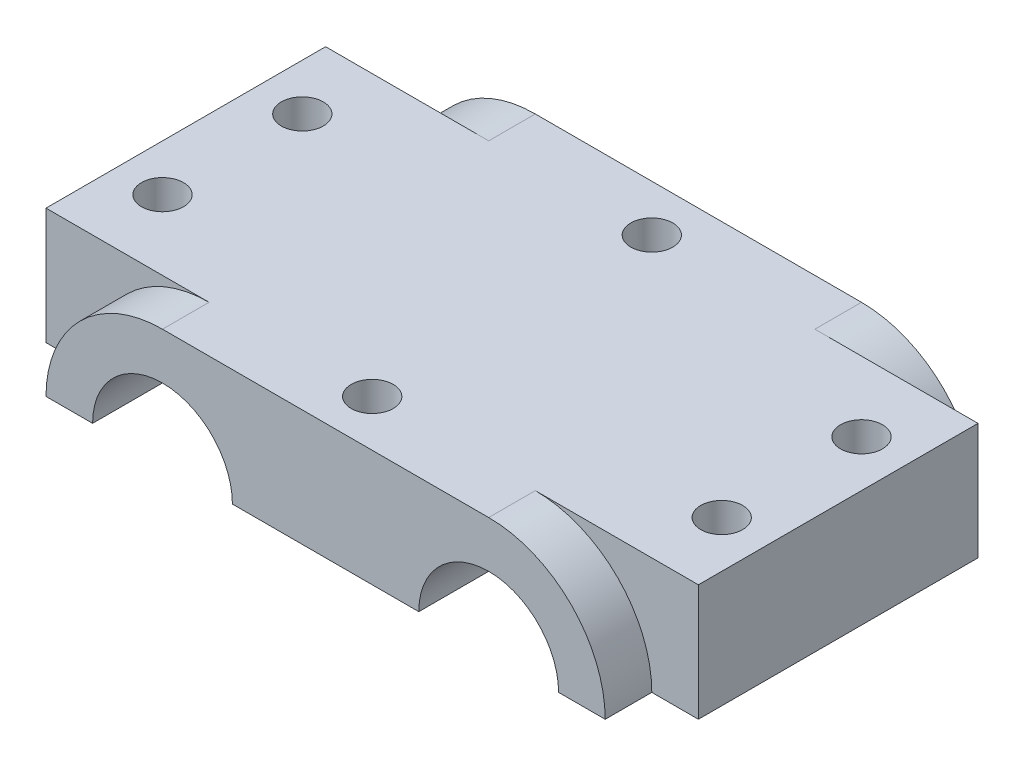
ISO-10303-21;
HEADER;
FILE_DESCRIPTION(('STEP AP214'),'2;1');
FILE_NAME('part.step','',(''),(''),'','','');
FILE_SCHEMA(('AUTOMOTIVE_DESIGN { 1 0 10303 214 1 1 1 1 }'));
ENDSEC;
DATA;
#1=APPLICATION_CONTEXT('core data for automotive mechanical design processes');
#2=APPLICATION_PROTOCOL_DEFINITION('international standard','automotive_design',2000,#1);
#3=PRODUCT_CONTEXT('',#1,'mechanical');
#4=PRODUCT('Part','Part','',(#3));
#5=PRODUCT_RELATED_PRODUCT_CATEGORY('part','',(#4));
#6=PRODUCT_DEFINITION_FORMATION('','',#4);
#7=PRODUCT_DEFINITION_CONTEXT('part definition',#1,'design');
#8=PRODUCT_DEFINITION('design','',#6,#7);
#9=PRODUCT_DEFINITION_SHAPE('','',#8);
#10=(LENGTH_UNIT() NAMED_UNIT(*) SI_UNIT(.MILLI.,.METRE.));
#11=(NAMED_UNIT(*) PLANE_ANGLE_UNIT() SI_UNIT($,.RADIAN.));
#12=(NAMED_UNIT(*) SI_UNIT($,.STERADIAN.) SOLID_ANGLE_UNIT());
#13=UNCERTAINTY_MEASURE_WITH_UNIT(LENGTH_MEASURE(1.E-05),#10,'distance_accuracy_value','');
#14=(GEOMETRIC_REPRESENTATION_CONTEXT(3) GLOBAL_UNCERTAINTY_ASSIGNED_CONTEXT((#13)) GLOBAL_UNIT_ASSIGNED_CONTEXT((#10,
#11,#12)) REPRESENTATION_CONTEXT('',''));
#15=CARTESIAN_POINT('',(0.,0.,0.));
#16=DIRECTION('',(0.,0.,1.));
#17=DIRECTION('',(1.,0.,0.));
#18=AXIS2_PLACEMENT_3D('',#15,#16,#17);
#19=CARTESIAN_POINT('',(0.,0.,30.));
#20=DIRECTION('',(0.,1.,0.));
#21=DIRECTION('',(0.,0.,1.));
#22=AXIS2_PLACEMENT_3D('',#19,#20,#21);
#23=PLANE('',#22);
#24=DIRECTION('',(1.,0.,0.));
#25=VECTOR('',#24,1.);
#26=CARTESIAN_POINT('',(0.,0.,0.));
#27=LINE('',#26,#25);
#28=CARTESIAN_POINT('',(0.,0.,0.));
#29=VERTEX_POINT('',#28);
#30=CARTESIAN_POINT('',(5.,0.,0.));
#31=VERTEX_POINT('',#30);
#32=EDGE_CURVE('E243',#29,#31,#27,.T.);
#33=ORIENTED_EDGE('',*,*,#32,.T.);
#34=DIRECTION('',(0.,0.,1.));
#35=VECTOR('',#34,1.);
#36=CARTESIAN_POINT('',(5.,0.,-5.));
#37=LINE('',#36,#35);
#38=CARTESIAN_POINT('',(5.,0.,-5.));
#39=VERTEX_POINT('',#38);
#40=EDGE_CURVE('E204',#39,#31,#37,.T.);
#41=ORIENTED_EDGE('',*,*,#40,.F.);
#42=DIRECTION('',(-1.,0.,0.));
#43=VECTOR('',#42,1.);
#44=CARTESIAN_POINT('',(5.,0.,-5.));
#45=LINE('',#44,#43);
#46=CARTESIAN_POINT('',(10.,0.,-5.));
#47=VERTEX_POINT('',#46);
#48=EDGE_CURVE('E183',#47,#39,#45,.T.);
#49=ORIENTED_EDGE('',*,*,#48,.F.);
#50=DIRECTION('',(0.,0.,-1.));
#51=VECTOR('',#50,1.);
#52=CARTESIAN_POINT('',(10.,0.,30.));
#53=LINE('',#52,#51);
#54=CARTESIAN_POINT('',(10.,0.,35.));
#55=VERTEX_POINT('',#54);
#56=EDGE_CURVE('E11',#55,#47,#53,.T.);
#57=ORIENTED_EDGE('',*,*,#56,.F.);
#58=DIRECTION('',(1.,0.,0.));
#59=VECTOR('',#58,1.);
#60=CARTESIAN_POINT('',(5.,0.,35.));
#61=LINE('',#60,#59);
#62=CARTESIAN_POINT('',(5.,0.,35.));
#63=VERTEX_POINT('',#62);
#64=EDGE_CURVE('E211',#63,#55,#61,.T.);
#65=ORIENTED_EDGE('',*,*,#64,.F.);
#66=DIRECTION('',(0.,0.,-1.));
#67=VECTOR('',#66,1.);
#68=CARTESIAN_POINT('',(5.,0.,35.));
#69=LINE('',#68,#67);
#70=CARTESIAN_POINT('',(5.,0.,30.));
#71=VERTEX_POINT('',#70);
#72=EDGE_CURVE('E240',#63,#71,#69,.T.);
#73=ORIENTED_EDGE('',*,*,#72,.T.);
#74=DIRECTION('',(1.,0.,0.));
#75=VECTOR('',#74,1.);
#76=CARTESIAN_POINT('',(0.,0.,30.));
#77=LINE('',#76,#75);
#78=CARTESIAN_POINT('',(0.,0.,30.));
#79=VERTEX_POINT('',#78);
#80=EDGE_CURVE('E244',#79,#71,#77,.T.);
#81=ORIENTED_EDGE('',*,*,#80,.F.);
#82=DIRECTION('',(0.,0.,-1.));
#83=VECTOR('',#82,1.);
#84=CARTESIAN_POINT('',(0.,0.,30.));
#85=LINE('',#84,#83);
#86=EDGE_CURVE('E256',#79,#29,#85,.T.);
#87=ORIENTED_EDGE('',*,*,#86,.T.);
#88=EDGE_LOOP('',(#33,#41,#49,#57,#65,#73,#81,#87));
#89=FACE_BOUND('',#88,.T.);
#90=CARTESIAN_POINT('',(5.,0.,7.5));
#91=DIRECTION('',(0.,-1.,0.));
#92=DIRECTION('',(0.,0.,-1.));
#93=AXIS2_PLACEMENT_3D('',#90,#91,#92);
#94=CIRCLE('',#93,2.25);
#95=CARTESIAN_POINT('',(5.,0.,5.25000000000001));
#96=VERTEX_POINT('',#95);
#97=EDGE_CURVE('E194',#96,#96,#94,.T.);
#98=ORIENTED_EDGE('',*,*,#97,.F.);
#99=EDGE_LOOP('',(#98));
#100=FACE_BOUND('',#99,.T.);
#101=CARTESIAN_POINT('',(5.,0.,22.5));
#102=DIRECTION('',(0.,1.,0.));
#103=DIRECTION('',(0.,0.,1.));
#104=AXIS2_PLACEMENT_3D('',#101,#102,#103);
#105=CIRCLE('',#104,2.25);
#106=CARTESIAN_POINT('',(5.,0.,24.75));
#107=VERTEX_POINT('',#106);
#108=EDGE_CURVE('E447',#107,#107,#105,.T.);
#109=ORIENTED_EDGE('',*,*,#108,.T.);
#110=EDGE_LOOP('',(#109));
#111=FACE_BOUND('',#110,.T.);
#112=ADVANCED_FACE('F40',(#89,#100,#111),#23,.F.);
#113=CARTESIAN_POINT('',(25.,0.,30.));
#114=DIRECTION('',(0.,1.,0.));
#115=DIRECTION('',(0.,0.,1.));
#116=AXIS2_PLACEMENT_3D('',#113,#114,#115);
#117=PLANE('',#116);
#118=CARTESIAN_POINT('',(35.,0.,0.));
#119=DIRECTION('',(0.,1.,0.));
#120=DIRECTION('',(0.,0.,1.));
#121=AXIS2_PLACEMENT_3D('',#118,#119,#120);
#122=CIRCLE('',#121,2.25);
#123=CARTESIAN_POINT('',(35.,0.,2.25));
#124=VERTEX_POINT('',#123);
#125=EDGE_CURVE('E417',#124,#124,#122,.T.);
#126=ORIENTED_EDGE('',*,*,#125,.T.);
#127=EDGE_LOOP('',(#126));
#128=FACE_BOUND('',#127,.T.);
#129=DIRECTION('',(0.,0.,-1.));
#130=VECTOR('',#129,1.);
#131=CARTESIAN_POINT('',(25.,0.,30.));
#132=LINE('',#131,#130);
#133=CARTESIAN_POINT('',(25.,0.,35.));
#134=VERTEX_POINT('',#133);
#135=CARTESIAN_POINT('',(25.,0.,-5.));
#136=VERTEX_POINT('',#135);
#137=EDGE_CURVE('E47',#134,#136,#132,.T.);
#138=ORIENTED_EDGE('',*,*,#137,.T.);
#139=DIRECTION('',(-1.,0.,0.));
#140=VECTOR('',#139,1.);
#141=CARTESIAN_POINT('',(45.,0.,-5.));
#142=LINE('',#141,#140);
#143=CARTESIAN_POINT('',(45.,0.,-5.));
#144=VERTEX_POINT('',#143);
#145=EDGE_CURVE('E163',#144,#136,#142,.T.);
#146=ORIENTED_EDGE('',*,*,#145,.F.);
#147=DIRECTION('',(0.,0.,-1.));
#148=VECTOR('',#147,1.);
#149=CARTESIAN_POINT('',(45.,0.,30.));
#150=LINE('',#149,#148);
#151=CARTESIAN_POINT('',(45.,0.,35.));
#152=VERTEX_POINT('',#151);
#153=EDGE_CURVE('E150',#152,#144,#150,.T.);
#154=ORIENTED_EDGE('',*,*,#153,.F.);
#155=DIRECTION('',(1.,0.,0.));
#156=VECTOR('',#155,1.);
#157=CARTESIAN_POINT('',(25.,0.,35.));
#158=LINE('',#157,#156);
#159=EDGE_CURVE('E218',#134,#152,#158,.T.);
#160=ORIENTED_EDGE('',*,*,#159,.F.);
#161=EDGE_LOOP('',(#138,#146,#154,#160));
#162=FACE_BOUND('',#161,.T.);
#163=CARTESIAN_POINT('',(35.,0.,30.));
#164=DIRECTION('',(0.,-1.,0.));
#165=DIRECTION('',(0.,0.,-1.));
#166=AXIS2_PLACEMENT_3D('',#163,#164,#165);
#167=CIRCLE('',#166,2.25);
#168=CARTESIAN_POINT('',(35.,0.,27.75));
#169=VERTEX_POINT('',#168);
#170=EDGE_CURVE('E441',#169,#169,#167,.T.);
#171=ORIENTED_EDGE('',*,*,#170,.F.);
#172=EDGE_LOOP('',(#171));
#173=FACE_BOUND('',#172,.T.);
#174=ADVANCED_FACE('F164',(#128,#162,#173),#117,.F.);
#175=CARTESIAN_POINT('',(70.,0.,30.));
#176=DIRECTION('',(0.,1.,0.));
#177=DIRECTION('',(0.,0.,1.));
#178=AXIS2_PLACEMENT_3D('',#175,#176,#177);
#179=PLANE('',#178);
#180=CARTESIAN_POINT('',(65.,0.,7.5));
#181=DIRECTION('',(0.,1.,0.));
#182=DIRECTION('',(0.,0.,1.));
#183=AXIS2_PLACEMENT_3D('',#180,#181,#182);
#184=CIRCLE('',#183,2.25);
#185=CARTESIAN_POINT('',(65.,0.,9.75));
#186=VERTEX_POINT('',#185);
#187=EDGE_CURVE('E429',#186,#186,#184,.T.);
#188=ORIENTED_EDGE('',*,*,#187,.T.);
#189=EDGE_LOOP('',(#188));
#190=FACE_BOUND('',#189,.T.);
#191=DIRECTION('',(0.,0.,-1.));
#192=VECTOR('',#191,1.);
#193=CARTESIAN_POINT('',(60.,0.,30.));
#194=LINE('',#193,#192);
#195=CARTESIAN_POINT('',(60.,0.,35.));
#196=VERTEX_POINT('',#195);
#197=CARTESIAN_POINT('',(60.,0.,-5.));
#198=VERTEX_POINT('',#197);
#199=EDGE_CURVE('E160',#196,#198,#194,.T.);
#200=ORIENTED_EDGE('',*,*,#199,.T.);
#201=DIRECTION('',(-1.,0.,0.));
#202=VECTOR('',#201,1.);
#203=CARTESIAN_POINT('',(65.,0.,-5.));
#204=LINE('',#203,#202);
#205=CARTESIAN_POINT('',(65.,0.,-5.));
#206=VERTEX_POINT('',#205);
#207=EDGE_CURVE('E174',#206,#198,#204,.T.);
#208=ORIENTED_EDGE('',*,*,#207,.F.);
#209=DIRECTION('',(0.,0.,1.));
#210=VECTOR('',#209,1.);
#211=CARTESIAN_POINT('',(65.,0.,-5.));
#212=LINE('',#211,#210);
#213=CARTESIAN_POINT('',(65.,0.,0.));
#214=VERTEX_POINT('',#213);
#215=EDGE_CURVE('E192',#206,#214,#212,.T.);
#216=ORIENTED_EDGE('',*,*,#215,.T.);
#217=DIRECTION('',(1.,0.,0.));
#218=VECTOR('',#217,1.);
#219=CARTESIAN_POINT('',(70.,0.,0.));
#220=LINE('',#219,#218);
#221=CARTESIAN_POINT('',(70.,0.,0.));
#222=VERTEX_POINT('',#221);
#223=EDGE_CURVE('E54',#214,#222,#220,.T.);
#224=ORIENTED_EDGE('',*,*,#223,.T.);
#225=DIRECTION('',(0.,0.,-1.));
#226=VECTOR('',#225,1.);
#227=CARTESIAN_POINT('',(70.,0.,30.));
#228=LINE('',#227,#226);
#229=CARTESIAN_POINT('',(70.,0.,30.));
#230=VERTEX_POINT('',#229);
#231=EDGE_CURVE('E274',#230,#222,#228,.T.);
#232=ORIENTED_EDGE('',*,*,#231,.F.);
#233=DIRECTION('',(1.,0.,0.));
#234=VECTOR('',#233,1.);
#235=CARTESIAN_POINT('',(70.,0.,30.));
#236=LINE('',#235,#234);
#237=CARTESIAN_POINT('',(65.,0.,30.));
#238=VERTEX_POINT('',#237);
#239=EDGE_CURVE('E246',#238,#230,#236,.T.);
#240=ORIENTED_EDGE('',*,*,#239,.F.);
#241=DIRECTION('',(0.,0.,-1.));
#242=VECTOR('',#241,1.);
#243=CARTESIAN_POINT('',(65.,0.,35.));
#244=LINE('',#243,#242);
#245=CARTESIAN_POINT('',(65.,0.,35.));
#246=VERTEX_POINT('',#245);
#247=EDGE_CURVE('E237',#246,#238,#244,.T.);
#248=ORIENTED_EDGE('',*,*,#247,.F.);
#249=DIRECTION('',(1.,0.,0.));
#250=VECTOR('',#249,1.);
#251=CARTESIAN_POINT('',(65.,0.,35.));
#252=LINE('',#251,#250);
#253=EDGE_CURVE('E221',#196,#246,#252,.T.);
#254=ORIENTED_EDGE('',*,*,#253,.F.);
#255=EDGE_LOOP('',(#200,#208,#216,#224,#232,#240,#248,#254));
#256=FACE_BOUND('',#255,.T.);
#257=CARTESIAN_POINT('',(65.,0.,22.5));
#258=DIRECTION('',(0.,-1.,0.));
#259=DIRECTION('',(0.,0.,-1.));
#260=AXIS2_PLACEMENT_3D('',#257,#258,#259);
#261=CIRCLE('',#260,2.25);
#262=CARTESIAN_POINT('',(65.,0.,20.25));
#263=VERTEX_POINT('',#262);
#264=EDGE_CURVE('E435',#263,#263,#261,.T.);
#265=ORIENTED_EDGE('',*,*,#264,.F.);
#266=EDGE_LOOP('',(#265));
#267=FACE_BOUND('',#266,.T.);
#268=ADVANCED_FACE('F279',(#190,#256,#267),#179,.F.);
#269=CARTESIAN_POINT('',(0.,12.5,30.));
#270=DIRECTION('',(0.,-1.,0.));
#271=DIRECTION('',(0.,0.,-1.));
#272=AXIS2_PLACEMENT_3D('',#269,#270,#271);
#273=PLANE('',#272);
#274=CARTESIAN_POINT('',(65.,12.5,7.5));
#275=DIRECTION('',(0.,1.,0.));
#276=DIRECTION('',(0.,0.,1.));
#277=AXIS2_PLACEMENT_3D('',#274,#275,#276);
#278=CIRCLE('',#277,2.25);
#279=CARTESIAN_POINT('',(65.,12.5,9.75));
#280=VERTEX_POINT('',#279);
#281=EDGE_CURVE('E424',#280,#280,#278,.T.);
#282=ORIENTED_EDGE('',*,*,#281,.F.);
#283=EDGE_LOOP('',(#282));
#284=FACE_BOUND('',#283,.T.);
#285=DIRECTION('',(-1.,0.,0.));
#286=VECTOR('',#285,1.);
#287=CARTESIAN_POINT('',(0.,12.5,0.));
#288=LINE('',#287,#286);
#289=CARTESIAN_POINT('',(70.,12.5,0.));
#290=VERTEX_POINT('',#289);
#291=CARTESIAN_POINT('',(52.5,12.5,0.));
#292=VERTEX_POINT('',#291);
#293=EDGE_CURVE('E263',#290,#292,#288,.T.);
#294=ORIENTED_EDGE('',*,*,#293,.T.);
#295=DIRECTION('',(0.,0.,1.));
#296=VECTOR('',#295,1.);
#297=CARTESIAN_POINT('',(52.5,12.5,-5.));
#298=LINE('',#297,#296);
#299=CARTESIAN_POINT('',(52.5,12.5,-5.));
#300=VERTEX_POINT('',#299);
#301=EDGE_CURVE('E198',#300,#292,#298,.T.);
#302=ORIENTED_EDGE('',*,*,#301,.F.);
#303=DIRECTION('',(1.,0.,0.));
#304=VECTOR('',#303,1.);
#305=CARTESIAN_POINT('',(52.5,12.5,-5.));
#306=LINE('',#305,#304);
#307=CARTESIAN_POINT('',(17.5,12.5,-5.));
#308=VERTEX_POINT('',#307);
#309=EDGE_CURVE('E187',#308,#300,#306,.T.);
#310=ORIENTED_EDGE('',*,*,#309,.F.);
#311=DIRECTION('',(0.,0.,1.));
#312=VECTOR('',#311,1.);
#313=CARTESIAN_POINT('',(17.5,12.5,-5.));
#314=LINE('',#313,#312);
#315=CARTESIAN_POINT('',(17.5,12.5,0.));
#316=VERTEX_POINT('',#315);
#317=EDGE_CURVE('E201',#308,#316,#314,.T.);
#318=ORIENTED_EDGE('',*,*,#317,.T.);
#319=CARTESIAN_POINT('',(0.,12.5,0.));
#320=VERTEX_POINT('',#319);
#321=EDGE_CURVE('E262',#316,#320,#288,.T.);
#322=ORIENTED_EDGE('',*,*,#321,.T.);
#323=DIRECTION('',(0.,0.,-1.));
#324=VECTOR('',#323,1.);
#325=CARTESIAN_POINT('',(0.,12.5,30.));
#326=LINE('',#325,#324);
#327=CARTESIAN_POINT('',(0.,12.5,30.));
#328=VERTEX_POINT('',#327);
#329=EDGE_CURVE('E268',#328,#320,#326,.T.);
#330=ORIENTED_EDGE('',*,*,#329,.F.);
#331=DIRECTION('',(-1.,0.,0.));
#332=VECTOR('',#331,1.);
#333=CARTESIAN_POINT('',(0.,12.5,30.));
#334=LINE('',#333,#332);
#335=CARTESIAN_POINT('',(17.5,12.5,30.));
#336=VERTEX_POINT('',#335);
#337=EDGE_CURVE('E251',#336,#328,#334,.T.);
#338=ORIENTED_EDGE('',*,*,#337,.F.);
#339=DIRECTION('',(0.,0.,-1.));
#340=VECTOR('',#339,1.);
#341=CARTESIAN_POINT('',(17.5,12.5,35.));
#342=LINE('',#341,#340);
#343=CARTESIAN_POINT('',(17.5,12.5,35.));
#344=VERTEX_POINT('',#343);
#345=EDGE_CURVE('E227',#344,#336,#342,.T.);
#346=ORIENTED_EDGE('',*,*,#345,.F.);
#347=DIRECTION('',(-1.,0.,0.));
#348=VECTOR('',#347,1.);
#349=CARTESIAN_POINT('',(17.5,12.5,35.));
#350=LINE('',#349,#348);
#351=CARTESIAN_POINT('',(52.5,12.5,35.));
#352=VERTEX_POINT('',#351);
#353=EDGE_CURVE('E225',#352,#344,#350,.T.);
#354=ORIENTED_EDGE('',*,*,#353,.F.);
#355=DIRECTION('',(0.,0.,-1.));
#356=VECTOR('',#355,1.);
#357=CARTESIAN_POINT('',(52.5,12.5,35.));
#358=LINE('',#357,#356);
#359=CARTESIAN_POINT('',(52.5,12.5,30.));
#360=VERTEX_POINT('',#359);
#361=EDGE_CURVE('E234',#352,#360,#358,.T.);
#362=ORIENTED_EDGE('',*,*,#361,.T.);
#363=CARTESIAN_POINT('',(70.,12.5,30.));
#364=VERTEX_POINT('',#363);
#365=EDGE_CURVE('E252',#364,#360,#334,.T.);
#366=ORIENTED_EDGE('',*,*,#365,.F.);
#367=DIRECTION('',(0.,0.,-1.));
#368=VECTOR('',#367,1.);
#369=CARTESIAN_POINT('',(70.,12.5,30.));
#370=LINE('',#369,#368);
#371=EDGE_CURVE('E271',#364,#290,#370,.T.);
#372=ORIENTED_EDGE('',*,*,#371,.T.);
#373=EDGE_LOOP('',(#294,#302,#310,#318,#322,#330,#338,#346,#354,#362,#366,#372));
#374=FACE_BOUND('',#373,.T.);
#375=CARTESIAN_POINT('',(5.,12.5,7.5));
#376=DIRECTION('',(0.,-1.,0.));
#377=DIRECTION('',(0.,0.,-1.));
#378=AXIS2_PLACEMENT_3D('',#375,#376,#377);
#379=CIRCLE('',#378,2.25);
#380=CARTESIAN_POINT('',(5.,12.5,5.25000000000001));
#381=VERTEX_POINT('',#380);
#382=EDGE_CURVE('E179',#381,#381,#379,.T.);
#383=ORIENTED_EDGE('',*,*,#382,.T.);
#384=EDGE_LOOP('',(#383));
#385=FACE_BOUND('',#384,.T.);
#386=CARTESIAN_POINT('',(35.,12.5,0.));
#387=DIRECTION('',(0.,1.,0.));
#388=DIRECTION('',(0.,0.,1.));
#389=AXIS2_PLACEMENT_3D('',#386,#387,#388);
#390=CIRCLE('',#389,2.25);
#391=CARTESIAN_POINT('',(35.,12.5,2.25));
#392=VERTEX_POINT('',#391);
#393=EDGE_CURVE('E420',#392,#392,#390,.T.);
#394=ORIENTED_EDGE('',*,*,#393,.F.);
#395=EDGE_LOOP('',(#394));
#396=FACE_BOUND('',#395,.T.);
#397=CARTESIAN_POINT('',(65.,12.5,22.5));
#398=DIRECTION('',(0.,-1.,0.));
#399=DIRECTION('',(0.,0.,-1.));
#400=AXIS2_PLACEMENT_3D('',#397,#398,#399);
#401=CIRCLE('',#400,2.25);
#402=CARTESIAN_POINT('',(65.,12.5,20.25));
#403=VERTEX_POINT('',#402);
#404=EDGE_CURVE('E432',#403,#403,#401,.T.);
#405=ORIENTED_EDGE('',*,*,#404,.T.);
#406=EDGE_LOOP('',(#405));
#407=FACE_BOUND('',#406,.T.);
#408=CARTESIAN_POINT('',(35.,12.5,30.));
#409=DIRECTION('',(0.,-1.,0.));
#410=DIRECTION('',(0.,0.,-1.));
#411=AXIS2_PLACEMENT_3D('',#408,#409,#410);
#412=CIRCLE('',#411,2.25);
#413=CARTESIAN_POINT('',(35.,12.5,27.75));
#414=VERTEX_POINT('',#413);
#415=EDGE_CURVE('E438',#414,#414,#412,.T.);
#416=ORIENTED_EDGE('',*,*,#415,.T.);
#417=EDGE_LOOP('',(#416));
#418=FACE_BOUND('',#417,.T.);
#419=CARTESIAN_POINT('',(5.,12.5,22.5));
#420=DIRECTION('',(0.,1.,0.));
#421=DIRECTION('',(0.,0.,1.));
#422=AXIS2_PLACEMENT_3D('',#419,#420,#421);
#423=CIRCLE('',#422,2.25);
#424=CARTESIAN_POINT('',(5.,12.5,24.75));
#425=VERTEX_POINT('',#424);
#426=EDGE_CURVE('E444',#425,#425,#423,.T.);
#427=ORIENTED_EDGE('',*,*,#426,.F.);
#428=EDGE_LOOP('',(#427));
#429=FACE_BOUND('',#428,.T.);
#430=ADVANCED_FACE('F301',(#284,#374,#385,#396,#407,#418,#429),#273,.F.);
#431=CARTESIAN_POINT('',(17.5,0.,0.));
#432=DIRECTION('',(0.,0.,-1.));
#433=DIRECTION('',(-1.,0.,0.));
#434=AXIS2_PLACEMENT_3D('',#431,#432,#433);
#435=PLANE('',#434);
#436=CARTESIAN_POINT('',(52.5,0.,0.));
#437=DIRECTION('',(0.,0.,-1.));
#438=DIRECTION('',(1.,0.,0.));
#439=AXIS2_PLACEMENT_3D('',#436,#437,#438);
#440=CIRCLE('',#439,12.5);
#441=EDGE_CURVE('E58',#292,#214,#440,.T.);
#442=ORIENTED_EDGE('',*,*,#441,.F.);
#443=ORIENTED_EDGE('',*,*,#293,.F.);
#444=DIRECTION('',(0.,1.,0.));
#445=VECTOR('',#444,1.);
#446=CARTESIAN_POINT('',(70.,0.,0.));
#447=LINE('',#446,#445);
#448=EDGE_CURVE('E260',#222,#290,#447,.T.);
#449=ORIENTED_EDGE('',*,*,#448,.F.);
#450=ORIENTED_EDGE('',*,*,#223,.F.);
#451=EDGE_LOOP('',(#442,#443,#449,#450));
#452=FACE_BOUND('',#451,.T.);
#453=ADVANCED_FACE('F311',(#452),#435,.T.);
#454=CARTESIAN_POINT('',(17.5,0.,30.));
#455=DIRECTION('',(0.,0.,-1.));
#456=DIRECTION('',(-1.,0.,0.));
#457=AXIS2_PLACEMENT_3D('',#454,#455,#456);
#458=PLANE('',#457);
#459=CARTESIAN_POINT('',(17.5,0.,30.));
#460=DIRECTION('',(0.,0.,1.));
#461=DIRECTION('',(-1.,0.,0.));
#462=AXIS2_PLACEMENT_3D('',#459,#460,#461);
#463=CIRCLE('',#462,12.5);
#464=EDGE_CURVE('E207',#336,#71,#463,.T.);
#465=ORIENTED_EDGE('',*,*,#464,.F.);
#466=ORIENTED_EDGE('',*,*,#337,.T.);
#467=DIRECTION('',(0.,-1.,0.));
#468=VECTOR('',#467,1.);
#469=CARTESIAN_POINT('',(0.,0.,30.));
#470=LINE('',#469,#468);
#471=EDGE_CURVE('E254',#328,#79,#470,.T.);
#472=ORIENTED_EDGE('',*,*,#471,.T.);
#473=ORIENTED_EDGE('',*,*,#80,.T.);
#474=EDGE_LOOP('',(#465,#466,#472,#473));
#475=FACE_BOUND('',#474,.T.);
#476=ADVANCED_FACE('F313',(#475),#458,.F.);
#477=CARTESIAN_POINT('',(17.5,0.,30.));
#478=DIRECTION('',(0.,0.,-1.));
#479=DIRECTION('',(-1.,0.,0.));
#480=AXIS2_PLACEMENT_3D('',#477,#478,#479);
#481=CYLINDRICAL_SURFACE('',#480,7.5);
#482=ORIENTED_EDGE('',*,*,#56,.T.);
#483=CARTESIAN_POINT('',(17.5,0.,-5.));
#484=DIRECTION('',(0.,0.,1.));
#485=DIRECTION('',(-1.,0.,0.));
#486=AXIS2_PLACEMENT_3D('',#483,#484,#485);
#487=CIRCLE('',#486,7.5);
#488=EDGE_CURVE('E169',#136,#47,#487,.T.);
#489=ORIENTED_EDGE('',*,*,#488,.F.);
#490=ORIENTED_EDGE('',*,*,#137,.F.);
#491=CARTESIAN_POINT('',(17.5,0.,35.));
#492=DIRECTION('',(0.,0.,-1.));
#493=DIRECTION('',(-1.,0.,0.));
#494=AXIS2_PLACEMENT_3D('',#491,#492,#493);
#495=CIRCLE('',#494,7.5);
#496=EDGE_CURVE('E215',#55,#134,#495,.T.);
#497=ORIENTED_EDGE('',*,*,#496,.F.);
#498=EDGE_LOOP('',(#482,#489,#490,#497));
#499=FACE_BOUND('',#498,.T.);
#500=ADVANCED_FACE('F286',(#499),#481,.F.);
#501=CARTESIAN_POINT('',(52.5,0.,30.));
#502=DIRECTION('',(0.,0.,-1.));
#503=DIRECTION('',(-1.,0.,0.));
#504=AXIS2_PLACEMENT_3D('',#501,#502,#503);
#505=CYLINDRICAL_SURFACE('',#504,7.5);
#506=ORIENTED_EDGE('',*,*,#153,.T.);
#507=CARTESIAN_POINT('',(52.5,0.,-5.));
#508=DIRECTION('',(0.,0.,1.));
#509=DIRECTION('',(1.,0.,0.));
#510=AXIS2_PLACEMENT_3D('',#507,#508,#509);
#511=CIRCLE('',#510,7.5);
#512=EDGE_CURVE('E154',#198,#144,#511,.T.);
#513=ORIENTED_EDGE('',*,*,#512,.F.);
#514=ORIENTED_EDGE('',*,*,#199,.F.);
#515=CARTESIAN_POINT('',(52.5,0.,35.));
#516=DIRECTION('',(0.,0.,-1.));
#517=DIRECTION('',(1.,0.,0.));
#518=AXIS2_PLACEMENT_3D('',#515,#516,#517);
#519=CIRCLE('',#518,7.5);
#520=EDGE_CURVE('E156',#152,#196,#519,.T.);
#521=ORIENTED_EDGE('',*,*,#520,.F.);
#522=EDGE_LOOP('',(#506,#513,#514,#521));
#523=FACE_BOUND('',#522,.T.);
#524=ADVANCED_FACE('F152',(#523),#505,.F.);
#525=CARTESIAN_POINT('',(70.,0.,30.));
#526=DIRECTION('',(-1.,0.,0.));
#527=DIRECTION('',(0.,0.,1.));
#528=AXIS2_PLACEMENT_3D('',#525,#526,#527);
#529=PLANE('',#528);
#530=ORIENTED_EDGE('',*,*,#448,.T.);
#531=ORIENTED_EDGE('',*,*,#371,.F.);
#532=DIRECTION('',(0.,1.,0.));
#533=VECTOR('',#532,1.);
#534=CARTESIAN_POINT('',(70.,0.,30.));
#535=LINE('',#534,#533);
#536=EDGE_CURVE('E249',#230,#364,#535,.T.);
#537=ORIENTED_EDGE('',*,*,#536,.F.);
#538=ORIENTED_EDGE('',*,*,#231,.T.);
#539=EDGE_LOOP('',(#530,#531,#537,#538));
#540=FACE_BOUND('',#539,.T.);
#541=ADVANCED_FACE('F309',(#540),#529,.F.);
#542=CARTESIAN_POINT('',(0.,0.,30.));
#543=DIRECTION('',(1.,0.,0.));
#544=DIRECTION('',(0.,0.,-1.));
#545=AXIS2_PLACEMENT_3D('',#542,#543,#544);
#546=PLANE('',#545);
#547=DIRECTION('',(0.,-1.,0.));
#548=VECTOR('',#547,1.);
#549=CARTESIAN_POINT('',(0.,0.,0.));
#550=LINE('',#549,#548);
#551=EDGE_CURVE('E247',#320,#29,#550,.T.);
#552=ORIENTED_EDGE('',*,*,#551,.T.);
#553=ORIENTED_EDGE('',*,*,#86,.F.);
#554=ORIENTED_EDGE('',*,*,#471,.F.);
#555=ORIENTED_EDGE('',*,*,#329,.T.);
#556=EDGE_LOOP('',(#552,#553,#554,#555));
#557=FACE_BOUND('',#556,.T.);
#558=ADVANCED_FACE('F349',(#557),#546,.F.);
#559=CARTESIAN_POINT('',(52.5,0.,30.));
#560=DIRECTION('',(0.,0.,1.));
#561=DIRECTION('',(1.,0.,0.));
#562=AXIS2_PLACEMENT_3D('',#559,#560,#561);
#563=CIRCLE('',#562,12.5);
#564=EDGE_CURVE('E212',#238,#360,#563,.T.);
#565=ORIENTED_EDGE('',*,*,#564,.F.);
#566=ORIENTED_EDGE('',*,*,#239,.T.);
#567=ORIENTED_EDGE('',*,*,#536,.T.);
#568=ORIENTED_EDGE('',*,*,#365,.T.);
#569=EDGE_LOOP('',(#565,#566,#567,#568));
#570=FACE_BOUND('',#569,.T.);
#571=ADVANCED_FACE('F322',(#570),#458,.F.);
#572=CARTESIAN_POINT('',(17.5,0.,0.));
#573=DIRECTION('',(0.,0.,-1.));
#574=DIRECTION('',(-1.,0.,0.));
#575=AXIS2_PLACEMENT_3D('',#572,#573,#574);
#576=CIRCLE('',#575,12.5);
#577=EDGE_CURVE('E176',#31,#316,#576,.T.);
#578=ORIENTED_EDGE('',*,*,#577,.F.);
#579=ORIENTED_EDGE('',*,*,#32,.F.);
#580=ORIENTED_EDGE('',*,*,#551,.F.);
#581=ORIENTED_EDGE('',*,*,#321,.F.);
#582=EDGE_LOOP('',(#578,#579,#580,#581));
#583=FACE_BOUND('',#582,.T.);
#584=ADVANCED_FACE('F315',(#583),#435,.T.);
#585=CARTESIAN_POINT('',(17.5,0.,35.));
#586=DIRECTION('',(0.,0.,-1.));
#587=DIRECTION('',(-1.,0.,0.));
#588=AXIS2_PLACEMENT_3D('',#585,#586,#587);
#589=CYLINDRICAL_SURFACE('',#588,12.5);
#590=ORIENTED_EDGE('',*,*,#464,.T.);
#591=ORIENTED_EDGE('',*,*,#72,.F.);
#592=CARTESIAN_POINT('',(17.5,0.,35.));
#593=DIRECTION('',(0.,0.,1.));
#594=DIRECTION('',(-1.,0.,0.));
#595=AXIS2_PLACEMENT_3D('',#592,#593,#594);
#596=CIRCLE('',#595,12.5);
#597=EDGE_CURVE('E208',#344,#63,#596,.T.);
#598=ORIENTED_EDGE('',*,*,#597,.F.);
#599=ORIENTED_EDGE('',*,*,#345,.T.);
#600=EDGE_LOOP('',(#590,#591,#598,#599));
#601=FACE_BOUND('',#600,.T.);
#602=ADVANCED_FACE('F327',(#601),#589,.T.);
#603=CARTESIAN_POINT('',(52.5,0.,35.));
#604=DIRECTION('',(0.,0.,-1.));
#605=DIRECTION('',(-1.,0.,0.));
#606=AXIS2_PLACEMENT_3D('',#603,#604,#605);
#607=CYLINDRICAL_SURFACE('',#606,12.5);
#608=ORIENTED_EDGE('',*,*,#564,.T.);
#609=ORIENTED_EDGE('',*,*,#361,.F.);
#610=CARTESIAN_POINT('',(52.5,0.,35.));
#611=DIRECTION('',(0.,0.,1.));
#612=DIRECTION('',(1.,0.,0.));
#613=AXIS2_PLACEMENT_3D('',#610,#611,#612);
#614=CIRCLE('',#613,12.5);
#615=EDGE_CURVE('E223',#246,#352,#614,.T.);
#616=ORIENTED_EDGE('',*,*,#615,.F.);
#617=ORIENTED_EDGE('',*,*,#247,.T.);
#618=EDGE_LOOP('',(#608,#609,#616,#617));
#619=FACE_BOUND('',#618,.T.);
#620=ADVANCED_FACE('F374',(#619),#607,.T.);
#621=CARTESIAN_POINT('',(17.5,0.,35.));
#622=DIRECTION('',(0.,0.,-1.));
#623=DIRECTION('',(-1.,0.,0.));
#624=AXIS2_PLACEMENT_3D('',#621,#622,#623);
#625=PLANE('',#624);
#626=ORIENTED_EDGE('',*,*,#597,.T.);
#627=ORIENTED_EDGE('',*,*,#64,.T.);
#628=ORIENTED_EDGE('',*,*,#496,.T.);
#629=ORIENTED_EDGE('',*,*,#159,.T.);
#630=ORIENTED_EDGE('',*,*,#520,.T.);
#631=ORIENTED_EDGE('',*,*,#253,.T.);
#632=ORIENTED_EDGE('',*,*,#615,.T.);
#633=ORIENTED_EDGE('',*,*,#353,.T.);
#634=EDGE_LOOP('',(#626,#627,#628,#629,#630,#631,#632,#633));
#635=FACE_BOUND('',#634,.T.);
#636=ADVANCED_FACE('F283',(#635),#625,.F.);
#637=CARTESIAN_POINT('',(17.5,0.,-5.));
#638=DIRECTION('',(0.,0.,1.));
#639=DIRECTION('',(1.,0.,0.));
#640=AXIS2_PLACEMENT_3D('',#637,#638,#639);
#641=CYLINDRICAL_SURFACE('',#640,12.5);
#642=ORIENTED_EDGE('',*,*,#577,.T.);
#643=ORIENTED_EDGE('',*,*,#317,.F.);
#644=CARTESIAN_POINT('',(17.5,0.,-5.));
#645=DIRECTION('',(0.,0.,-1.));
#646=DIRECTION('',(-1.,0.,0.));
#647=AXIS2_PLACEMENT_3D('',#644,#645,#646);
#648=CIRCLE('',#647,12.5);
#649=EDGE_CURVE('E185',#39,#308,#648,.T.);
#650=ORIENTED_EDGE('',*,*,#649,.F.);
#651=ORIENTED_EDGE('',*,*,#40,.T.);
#652=EDGE_LOOP('',(#642,#643,#650,#651));
#653=FACE_BOUND('',#652,.T.);
#654=ADVANCED_FACE('F295',(#653),#641,.T.);
#655=CARTESIAN_POINT('',(52.5,0.,-5.));
#656=DIRECTION('',(0.,0.,1.));
#657=DIRECTION('',(1.,0.,0.));
#658=AXIS2_PLACEMENT_3D('',#655,#656,#657);
#659=CYLINDRICAL_SURFACE('',#658,12.5);
#660=ORIENTED_EDGE('',*,*,#441,.T.);
#661=ORIENTED_EDGE('',*,*,#215,.F.);
#662=CARTESIAN_POINT('',(52.5,0.,-5.));
#663=DIRECTION('',(0.,0.,-1.));
#664=DIRECTION('',(1.,0.,0.));
#665=AXIS2_PLACEMENT_3D('',#662,#663,#664);
#666=CIRCLE('',#665,12.5);
#667=EDGE_CURVE('E189',#300,#206,#666,.T.);
#668=ORIENTED_EDGE('',*,*,#667,.F.);
#669=ORIENTED_EDGE('',*,*,#301,.T.);
#670=EDGE_LOOP('',(#660,#661,#668,#669));
#671=FACE_BOUND('',#670,.T.);
#672=ADVANCED_FACE('F304',(#671),#659,.T.);
#673=CARTESIAN_POINT('',(52.5,0.,-5.));
#674=DIRECTION('',(0.,0.,1.));
#675=DIRECTION('',(1.,0.,0.));
#676=AXIS2_PLACEMENT_3D('',#673,#674,#675);
#677=PLANE('',#676);
#678=ORIENTED_EDGE('',*,*,#512,.T.);
#679=ORIENTED_EDGE('',*,*,#145,.T.);
#680=ORIENTED_EDGE('',*,*,#488,.T.);
#681=ORIENTED_EDGE('',*,*,#48,.T.);
#682=ORIENTED_EDGE('',*,*,#649,.T.);
#683=ORIENTED_EDGE('',*,*,#309,.T.);
#684=ORIENTED_EDGE('',*,*,#667,.T.);
#685=ORIENTED_EDGE('',*,*,#207,.T.);
#686=EDGE_LOOP('',(#678,#679,#680,#681,#682,#683,#684,#685));
#687=FACE_BOUND('',#686,.T.);
#688=ADVANCED_FACE('F172',(#687),#677,.F.);
#689=CARTESIAN_POINT('',(5.,0.,7.5));
#690=DIRECTION('',(0.,1.,0.));
#691=DIRECTION('',(0.,0.,1.));
#692=AXIS2_PLACEMENT_3D('',#689,#690,#691);
#693=CYLINDRICAL_SURFACE('',#692,2.25);
#694=ORIENTED_EDGE('',*,*,#97,.T.);
#695=EDGE_LOOP('',(#694));
#696=FACE_BOUND('',#695,.T.);
#697=ORIENTED_EDGE('',*,*,#382,.F.);
#698=EDGE_LOOP('',(#697));
#699=FACE_BOUND('',#698,.T.);
#700=ADVANCED_FACE('F390',(#696,#699),#693,.F.);
#701=CARTESIAN_POINT('',(35.,0.,0.));
#702=DIRECTION('',(0.,1.,0.));
#703=DIRECTION('',(0.,0.,1.));
#704=AXIS2_PLACEMENT_3D('',#701,#702,#703);
#705=CYLINDRICAL_SURFACE('',#704,2.25);
#706=ORIENTED_EDGE('',*,*,#125,.F.);
#707=EDGE_LOOP('',(#706));
#708=FACE_BOUND('',#707,.T.);
#709=ORIENTED_EDGE('',*,*,#393,.T.);
#710=EDGE_LOOP('',(#709));
#711=FACE_BOUND('',#710,.T.);
#712=ADVANCED_FACE('F393',(#708,#711),#705,.F.);
#713=CARTESIAN_POINT('',(65.,0.,7.5));
#714=DIRECTION('',(0.,1.,0.));
#715=DIRECTION('',(0.,0.,1.));
#716=AXIS2_PLACEMENT_3D('',#713,#714,#715);
#717=CYLINDRICAL_SURFACE('',#716,2.25);
#718=ORIENTED_EDGE('',*,*,#187,.F.);
#719=EDGE_LOOP('',(#718));
#720=FACE_BOUND('',#719,.T.);
#721=ORIENTED_EDGE('',*,*,#281,.T.);
#722=EDGE_LOOP('',(#721));
#723=FACE_BOUND('',#722,.T.);
#724=ADVANCED_FACE('F406',(#720,#723),#717,.F.);
#725=CARTESIAN_POINT('',(65.,0.,22.5));
#726=DIRECTION('',(0.,1.,0.));
#727=DIRECTION('',(0.,0.,1.));
#728=AXIS2_PLACEMENT_3D('',#725,#726,#727);
#729=CYLINDRICAL_SURFACE('',#728,2.25);
#730=ORIENTED_EDGE('',*,*,#264,.T.);
#731=EDGE_LOOP('',(#730));
#732=FACE_BOUND('',#731,.T.);
#733=ORIENTED_EDGE('',*,*,#404,.F.);
#734=EDGE_LOOP('',(#733));
#735=FACE_BOUND('',#734,.T.);
#736=ADVANCED_FACE('F402',(#732,#735),#729,.F.);
#737=CARTESIAN_POINT('',(35.,0.,30.));
#738=DIRECTION('',(0.,1.,0.));
#739=DIRECTION('',(0.,0.,1.));
#740=AXIS2_PLACEMENT_3D('',#737,#738,#739);
#741=CYLINDRICAL_SURFACE('',#740,2.25);
#742=ORIENTED_EDGE('',*,*,#170,.T.);
#743=EDGE_LOOP('',(#742));
#744=FACE_BOUND('',#743,.T.);
#745=ORIENTED_EDGE('',*,*,#415,.F.);
#746=EDGE_LOOP('',(#745));
#747=FACE_BOUND('',#746,.T.);
#748=ADVANCED_FACE('F398',(#744,#747),#741,.F.);
#749=CARTESIAN_POINT('',(5.,0.,22.5));
#750=DIRECTION('',(0.,1.,0.));
#751=DIRECTION('',(0.,0.,1.));
#752=AXIS2_PLACEMENT_3D('',#749,#750,#751);
#753=CYLINDRICAL_SURFACE('',#752,2.25);
#754=ORIENTED_EDGE('',*,*,#108,.F.);
#755=EDGE_LOOP('',(#754));
#756=FACE_BOUND('',#755,.T.);
#757=ORIENTED_EDGE('',*,*,#426,.T.);
#758=EDGE_LOOP('',(#757));
#759=FACE_BOUND('',#758,.T.);
#760=ADVANCED_FACE('F395',(#756,#759),#753,.F.);
#761=CLOSED_SHELL('',(#112,#174,#268,#430,#453,#476,#500,#524,#541,#558,#571,#584,#602,#620,
#636,#654,#672,#688,#700,#712,#724,#736,#748,#760));
#762=MANIFOLD_SOLID_BREP('B2',#761);
#763=ADVANCED_BREP_SHAPE_REPRESENTATION('',(#18,#762),#14);
#764=SHAPE_DEFINITION_REPRESENTATION(#9,#763);
ENDSEC;
END-ISO-10303-21;
